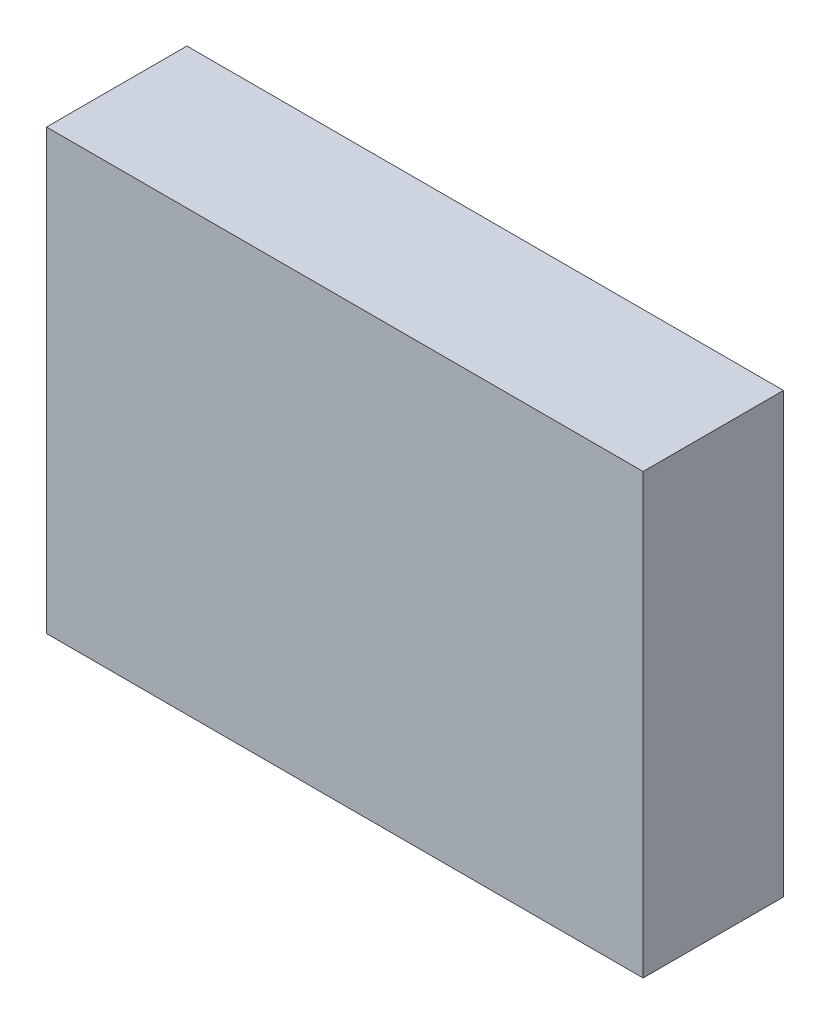
ISO-10303-21;
HEADER;
FILE_DESCRIPTION(('STEP AP214'),'2;1');
FILE_NAME('part.step','',(''),(''),'','','');
FILE_SCHEMA(('AUTOMOTIVE_DESIGN { 1 0 10303 214 1 1 1 1 }'));
ENDSEC;
DATA;
#1=APPLICATION_CONTEXT('core data for automotive mechanical design processes');
#2=APPLICATION_PROTOCOL_DEFINITION('international standard','automotive_design',2000,#1);
#3=PRODUCT_CONTEXT('',#1,'mechanical');
#4=PRODUCT('Part','Part','',(#3));
#5=PRODUCT_RELATED_PRODUCT_CATEGORY('part','',(#4));
#6=PRODUCT_DEFINITION_FORMATION('','',#4);
#7=PRODUCT_DEFINITION_CONTEXT('part definition',#1,'design');
#8=PRODUCT_DEFINITION('design','',#6,#7);
#9=PRODUCT_DEFINITION_SHAPE('','',#8);
#10=(LENGTH_UNIT() NAMED_UNIT(*) SI_UNIT(.MILLI.,.METRE.));
#11=(NAMED_UNIT(*) PLANE_ANGLE_UNIT() SI_UNIT($,.RADIAN.));
#12=(NAMED_UNIT(*) SI_UNIT($,.STERADIAN.) SOLID_ANGLE_UNIT());
#13=UNCERTAINTY_MEASURE_WITH_UNIT(LENGTH_MEASURE(1.E-05),#10,'distance_accuracy_value','');
#14=(GEOMETRIC_REPRESENTATION_CONTEXT(3) GLOBAL_UNCERTAINTY_ASSIGNED_CONTEXT((#13)) GLOBAL_UNIT_ASSIGNED_CONTEXT((#10,
#11,#12)) REPRESENTATION_CONTEXT('',''));
#15=CARTESIAN_POINT('',(0.,0.,0.));
#16=DIRECTION('',(0.,0.,1.));
#17=DIRECTION('',(1.,0.,0.));
#18=AXIS2_PLACEMENT_3D('',#15,#16,#17);
#19=CARTESIAN_POINT('',(26.9875,19.84375,12.7));
#20=DIRECTION('',(0.,0.,-1.));
#21=DIRECTION('',(-1.,0.,0.));
#22=AXIS2_PLACEMENT_3D('',#19,#20,#21);
#23=PLANE('',#22);
#24=DIRECTION('',(1.,0.,0.));
#25=VECTOR('',#24,1.);
#26=CARTESIAN_POINT('',(26.9875,19.84375,12.7));
#27=LINE('',#26,#25);
#28=CARTESIAN_POINT('',(-26.9875,19.84375,12.7));
#29=VERTEX_POINT('',#28);
#30=CARTESIAN_POINT('',(26.9875,19.84375,12.7));
#31=VERTEX_POINT('',#30);
#32=EDGE_CURVE('E26',#29,#31,#27,.T.);
#33=ORIENTED_EDGE('',*,*,#32,.F.);
#34=DIRECTION('',(0.,1.,0.));
#35=VECTOR('',#34,1.);
#36=CARTESIAN_POINT('',(-26.9875,19.84375,12.7));
#37=LINE('',#36,#35);
#38=CARTESIAN_POINT('',(-26.9875,-19.84375,12.7));
#39=VERTEX_POINT('',#38);
#40=EDGE_CURVE('E35',#39,#29,#37,.T.);
#41=ORIENTED_EDGE('',*,*,#40,.F.);
#42=DIRECTION('',(-1.,0.,0.));
#43=VECTOR('',#42,1.);
#44=CARTESIAN_POINT('',(26.9875,-19.84375,12.7));
#45=LINE('',#44,#43);
#46=CARTESIAN_POINT('',(26.9875,-19.84375,12.7));
#47=VERTEX_POINT('',#46);
#48=EDGE_CURVE('E71',#47,#39,#45,.T.);
#49=ORIENTED_EDGE('',*,*,#48,.F.);
#50=DIRECTION('',(0.,-1.,0.));
#51=VECTOR('',#50,1.);
#52=CARTESIAN_POINT('',(26.9875,19.84375,12.7));
#53=LINE('',#52,#51);
#54=EDGE_CURVE('E11',#31,#47,#53,.T.);
#55=ORIENTED_EDGE('',*,*,#54,.F.);
#56=EDGE_LOOP('',(#33,#41,#49,#55));
#57=FACE_BOUND('',#56,.T.);
#58=ADVANCED_FACE('F16',(#57),#23,.F.);
#59=CARTESIAN_POINT('',(26.9875,-19.84375,12.7));
#60=DIRECTION('',(-1.,0.,0.));
#61=DIRECTION('',(0.,0.,1.));
#62=AXIS2_PLACEMENT_3D('',#59,#60,#61);
#63=PLANE('',#62);
#64=DIRECTION('',(0.,0.,-1.));
#65=VECTOR('',#64,1.);
#66=CARTESIAN_POINT('',(26.9875,19.84375,12.7));
#67=LINE('',#66,#65);
#68=CARTESIAN_POINT('',(26.9875,19.84375,0.));
#69=VERTEX_POINT('',#68);
#70=EDGE_CURVE('E81',#31,#69,#67,.T.);
#71=ORIENTED_EDGE('',*,*,#70,.F.);
#72=ORIENTED_EDGE('',*,*,#54,.T.);
#73=DIRECTION('',(0.,0.,1.));
#74=VECTOR('',#73,1.);
#75=CARTESIAN_POINT('',(26.9875,-19.84375,12.7));
#76=LINE('',#75,#74);
#77=CARTESIAN_POINT('',(26.9875,-19.84375,0.));
#78=VERTEX_POINT('',#77);
#79=EDGE_CURVE('E79',#78,#47,#76,.T.);
#80=ORIENTED_EDGE('',*,*,#79,.F.);
#81=DIRECTION('',(0.,-1.,0.));
#82=VECTOR('',#81,1.);
#83=CARTESIAN_POINT('',(26.9875,-19.84375,0.));
#84=LINE('',#83,#82);
#85=EDGE_CURVE('E73',#69,#78,#84,.T.);
#86=ORIENTED_EDGE('',*,*,#85,.F.);
#87=EDGE_LOOP('',(#71,#72,#80,#86));
#88=FACE_BOUND('',#87,.T.);
#89=ADVANCED_FACE('F90',(#88),#63,.F.);
#90=CARTESIAN_POINT('',(-26.9875,19.84375,12.7));
#91=DIRECTION('',(0.,-1.,0.));
#92=DIRECTION('',(0.,0.,-1.));
#93=AXIS2_PLACEMENT_3D('',#90,#91,#92);
#94=PLANE('',#93);
#95=DIRECTION('',(0.,0.,-1.));
#96=VECTOR('',#95,1.);
#97=CARTESIAN_POINT('',(-26.9875,19.84375,12.7));
#98=LINE('',#97,#96);
#99=CARTESIAN_POINT('',(-26.9875,19.84375,0.));
#100=VERTEX_POINT('',#99);
#101=EDGE_CURVE('E64',#29,#100,#98,.T.);
#102=ORIENTED_EDGE('',*,*,#101,.F.);
#103=ORIENTED_EDGE('',*,*,#32,.T.);
#104=ORIENTED_EDGE('',*,*,#70,.T.);
#105=DIRECTION('',(1.,0.,0.));
#106=VECTOR('',#105,1.);
#107=CARTESIAN_POINT('',(-26.9875,19.84375,0.));
#108=LINE('',#107,#106);
#109=EDGE_CURVE('E57',#100,#69,#108,.T.);
#110=ORIENTED_EDGE('',*,*,#109,.F.);
#111=EDGE_LOOP('',(#102,#103,#104,#110));
#112=FACE_BOUND('',#111,.T.);
#113=ADVANCED_FACE('F87',(#112),#94,.F.);
#114=CARTESIAN_POINT('',(-26.9875,-19.84375,12.7));
#115=DIRECTION('',(1.,0.,0.));
#116=DIRECTION('',(0.,0.,-1.));
#117=AXIS2_PLACEMENT_3D('',#114,#115,#116);
#118=PLANE('',#117);
#119=DIRECTION('',(0.,0.,-1.));
#120=VECTOR('',#119,1.);
#121=CARTESIAN_POINT('',(-26.9875,-19.84375,12.7));
#122=LINE('',#121,#120);
#123=CARTESIAN_POINT('',(-26.9875,-19.84375,0.));
#124=VERTEX_POINT('',#123);
#125=EDGE_CURVE('E63',#39,#124,#122,.T.);
#126=ORIENTED_EDGE('',*,*,#125,.F.);
#127=ORIENTED_EDGE('',*,*,#40,.T.);
#128=ORIENTED_EDGE('',*,*,#101,.T.);
#129=DIRECTION('',(0.,1.,0.));
#130=VECTOR('',#129,1.);
#131=CARTESIAN_POINT('',(-26.9875,-19.84375,0.));
#132=LINE('',#131,#130);
#133=EDGE_CURVE('E60',#124,#100,#132,.T.);
#134=ORIENTED_EDGE('',*,*,#133,.F.);
#135=EDGE_LOOP('',(#126,#127,#128,#134));
#136=FACE_BOUND('',#135,.T.);
#137=ADVANCED_FACE('F62',(#136),#118,.F.);
#138=CARTESIAN_POINT('',(-26.9875,-19.84375,12.7));
#139=DIRECTION('',(0.,1.,0.));
#140=DIRECTION('',(0.,0.,1.));
#141=AXIS2_PLACEMENT_3D('',#138,#139,#140);
#142=PLANE('',#141);
#143=ORIENTED_EDGE('',*,*,#79,.T.);
#144=ORIENTED_EDGE('',*,*,#48,.T.);
#145=ORIENTED_EDGE('',*,*,#125,.T.);
#146=DIRECTION('',(-1.,0.,0.));
#147=VECTOR('',#146,1.);
#148=CARTESIAN_POINT('',(-26.9875,-19.84375,0.));
#149=LINE('',#148,#147);
#150=EDGE_CURVE('E20',#78,#124,#149,.T.);
#151=ORIENTED_EDGE('',*,*,#150,.F.);
#152=EDGE_LOOP('',(#143,#144,#145,#151));
#153=FACE_BOUND('',#152,.T.);
#154=ADVANCED_FACE('F70',(#153),#142,.F.);
#155=CARTESIAN_POINT('',(26.9875,19.84375,0.));
#156=DIRECTION('',(0.,0.,-1.));
#157=DIRECTION('',(-1.,0.,0.));
#158=AXIS2_PLACEMENT_3D('',#155,#156,#157);
#159=PLANE('',#158);
#160=ORIENTED_EDGE('',*,*,#133,.T.);
#161=ORIENTED_EDGE('',*,*,#109,.T.);
#162=ORIENTED_EDGE('',*,*,#85,.T.);
#163=ORIENTED_EDGE('',*,*,#150,.T.);
#164=EDGE_LOOP('',(#160,#161,#162,#163));
#165=FACE_BOUND('',#164,.T.);
#166=ADVANCED_FACE('F18',(#165),#159,.T.);
#167=CLOSED_SHELL('',(#58,#89,#113,#137,#154,#166));
#168=MANIFOLD_SOLID_BREP('B1',#167);
#169=ADVANCED_BREP_SHAPE_REPRESENTATION('',(#18,#168),#14);
#170=SHAPE_DEFINITION_REPRESENTATION(#9,#169);
ENDSEC;
END-ISO-10303-21;
